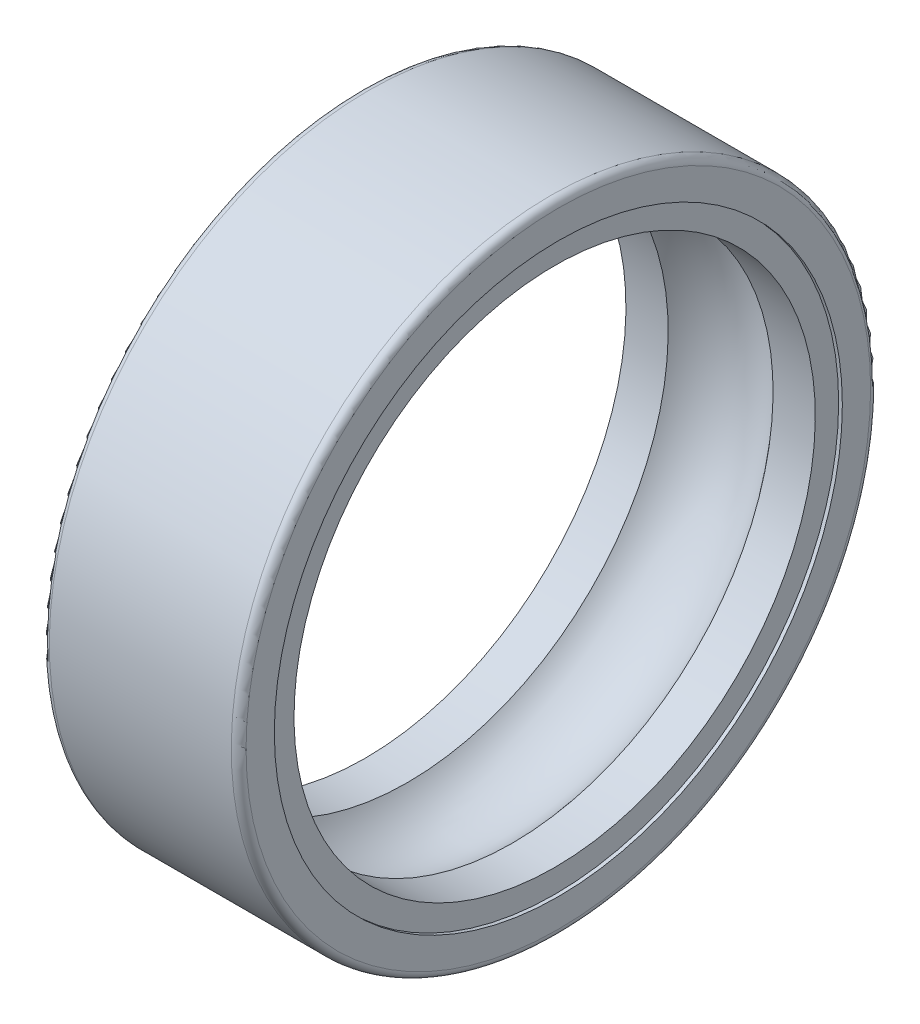
ISO-10303-21;
HEADER;
FILE_DESCRIPTION(('STEP AP214'),'2;1');
FILE_NAME('part.step','',(''),(''),'','','');
FILE_SCHEMA(('AUTOMOTIVE_DESIGN { 1 0 10303 214 1 1 1 1 }'));
ENDSEC;
DATA;
#1=APPLICATION_CONTEXT('core data for automotive mechanical design processes');
#2=APPLICATION_PROTOCOL_DEFINITION('international standard','automotive_design',2000,#1);
#3=PRODUCT_CONTEXT('',#1,'mechanical');
#4=PRODUCT('Part','Part','',(#3));
#5=PRODUCT_RELATED_PRODUCT_CATEGORY('part','',(#4));
#6=PRODUCT_DEFINITION_FORMATION('','',#4);
#7=PRODUCT_DEFINITION_CONTEXT('part definition',#1,'design');
#8=PRODUCT_DEFINITION('design','',#6,#7);
#9=PRODUCT_DEFINITION_SHAPE('','',#8);
#10=(LENGTH_UNIT() NAMED_UNIT(*) SI_UNIT(.MILLI.,.METRE.));
#11=(NAMED_UNIT(*) PLANE_ANGLE_UNIT() SI_UNIT($,.RADIAN.));
#12=(NAMED_UNIT(*) SI_UNIT($,.STERADIAN.) SOLID_ANGLE_UNIT());
#13=UNCERTAINTY_MEASURE_WITH_UNIT(LENGTH_MEASURE(1.E-05),#10,'distance_accuracy_value','');
#14=(GEOMETRIC_REPRESENTATION_CONTEXT(3) GLOBAL_UNCERTAINTY_ASSIGNED_CONTEXT((#13)) GLOBAL_UNIT_ASSIGNED_CONTEXT((#10,
#11,#12)) REPRESENTATION_CONTEXT('',''));
#15=CARTESIAN_POINT('',(0.,0.,0.));
#16=DIRECTION('',(0.,0.,1.));
#17=DIRECTION('',(1.,0.,0.));
#18=AXIS2_PLACEMENT_3D('',#15,#16,#17);
#19=CARTESIAN_POINT('',(3.7,0.,0.));
#20=DIRECTION('',(1.,0.,0.));
#21=DIRECTION('',(0.,0.,-1.));
#22=AXIS2_PLACEMENT_3D('',#19,#20,#21);
#23=TOROIDAL_SURFACE('',#22,12.7,0.3);
#24=CARTESIAN_POINT('',(3.7,0.,0.));
#25=DIRECTION('',(1.,0.,0.));
#26=DIRECTION('',(0.,1.,0.));
#27=AXIS2_PLACEMENT_3D('',#24,#25,#26);
#28=CIRCLE('',#27,13.);
#29=CARTESIAN_POINT('',(3.7,13.,0.));
#30=VERTEX_POINT('',#29);
#31=EDGE_CURVE('E11',#30,#30,#28,.T.);
#32=ORIENTED_EDGE('',*,*,#31,.T.);
#33=EDGE_LOOP('',(#32));
#34=FACE_BOUND('',#33,.T.);
#35=CARTESIAN_POINT('',(4.,0.,0.));
#36=DIRECTION('',(1.,0.,0.));
#37=DIRECTION('',(0.,1.,0.));
#38=AXIS2_PLACEMENT_3D('',#35,#36,#37);
#39=CIRCLE('',#38,12.7);
#40=CARTESIAN_POINT('',(4.,12.7,0.));
#41=VERTEX_POINT('',#40);
#42=EDGE_CURVE('E78',#41,#41,#39,.T.);
#43=ORIENTED_EDGE('',*,*,#42,.F.);
#44=EDGE_LOOP('',(#43));
#45=FACE_BOUND('',#44,.T.);
#46=ADVANCED_FACE('F16',(#34,#45),#23,.T.);
#47=CARTESIAN_POINT('',(0.,0.,0.));
#48=DIRECTION('',(-1.,0.,0.));
#49=DIRECTION('',(0.,1.,0.));
#50=AXIS2_PLACEMENT_3D('',#47,#48,#49);
#51=CYLINDRICAL_SURFACE('',#50,13.);
#52=CARTESIAN_POINT('',(-3.7,0.,0.));
#53=DIRECTION('',(1.,0.,0.));
#54=DIRECTION('',(0.,1.,0.));
#55=AXIS2_PLACEMENT_3D('',#52,#53,#54);
#56=CIRCLE('',#55,13.);
#57=CARTESIAN_POINT('',(-3.7,13.,0.));
#58=VERTEX_POINT('',#57);
#59=EDGE_CURVE('E25',#58,#58,#56,.T.);
#60=ORIENTED_EDGE('',*,*,#59,.T.);
#61=EDGE_LOOP('',(#60));
#62=FACE_BOUND('',#61,.T.);
#63=ORIENTED_EDGE('',*,*,#31,.F.);
#64=EDGE_LOOP('',(#63));
#65=FACE_BOUND('',#64,.T.);
#66=ADVANCED_FACE('F109',(#62,#65),#51,.T.);
#67=CARTESIAN_POINT('',(-3.7,0.,0.));
#68=DIRECTION('',(1.,0.,0.));
#69=DIRECTION('',(0.,0.,-1.));
#70=AXIS2_PLACEMENT_3D('',#67,#68,#69);
#71=TOROIDAL_SURFACE('',#70,12.7,0.3);
#72=CARTESIAN_POINT('',(-4.,0.,0.));
#73=DIRECTION('',(1.,0.,0.));
#74=DIRECTION('',(0.,1.,0.));
#75=AXIS2_PLACEMENT_3D('',#72,#73,#74);
#76=CIRCLE('',#75,12.7);
#77=CARTESIAN_POINT('',(-4.,12.7,0.));
#78=VERTEX_POINT('',#77);
#79=EDGE_CURVE('E75',#78,#78,#76,.T.);
#80=ORIENTED_EDGE('',*,*,#79,.T.);
#81=EDGE_LOOP('',(#80));
#82=FACE_BOUND('',#81,.T.);
#83=ORIENTED_EDGE('',*,*,#59,.F.);
#84=EDGE_LOOP('',(#83));
#85=FACE_BOUND('',#84,.T.);
#86=ADVANCED_FACE('F113',(#82,#85),#71,.T.);
#87=CARTESIAN_POINT('',(-4.,11.65,0.));
#88=DIRECTION('',(-1.,0.,0.));
#89=DIRECTION('',(0.,-1.,0.));
#90=AXIS2_PLACEMENT_3D('',#87,#88,#89);
#91=PLANE('',#90);
#92=ORIENTED_EDGE('',*,*,#79,.F.);
#93=EDGE_LOOP('',(#92));
#94=FACE_BOUND('',#93,.T.);
#95=CARTESIAN_POINT('',(-4.,0.,0.));
#96=DIRECTION('',(1.,0.,0.));
#97=DIRECTION('',(0.,0.,1.));
#98=AXIS2_PLACEMENT_3D('',#95,#96,#97);
#99=CIRCLE('',#98,11.55);
#100=CARTESIAN_POINT('',(-4.,0.,-11.55));
#101=VERTEX_POINT('',#100);
#102=EDGE_CURVE('E65',#101,#101,#99,.T.);
#103=ORIENTED_EDGE('',*,*,#102,.T.);
#104=EDGE_LOOP('',(#103));
#105=FACE_BOUND('',#104,.T.);
#106=ADVANCED_FACE('F66',(#94,#105),#91,.T.);
#107=CARTESIAN_POINT('',(0.,0.,0.));
#108=DIRECTION('',(-1.,0.,0.));
#109=DIRECTION('',(0.,1.,0.));
#110=AXIS2_PLACEMENT_3D('',#107,#108,#109);
#111=CYLINDRICAL_SURFACE('',#110,10.6);
#112=CARTESIAN_POINT('',(-2.13333333333333,0.,0.));
#113=DIRECTION('',(1.,0.,0.));
#114=DIRECTION('',(0.,1.,0.));
#115=AXIS2_PLACEMENT_3D('',#112,#113,#114);
#116=CIRCLE('',#115,10.6);
#117=CARTESIAN_POINT('',(-2.13333333333333,-10.6,0.));
#118=VERTEX_POINT('',#117);
#119=EDGE_CURVE('E81',#118,#118,#116,.T.);
#120=ORIENTED_EDGE('',*,*,#119,.T.);
#121=EDGE_LOOP('',(#120));
#122=FACE_BOUND('',#121,.T.);
#123=CARTESIAN_POINT('',(-3.85,0.,0.));
#124=DIRECTION('',(-1.,0.,0.));
#125=DIRECTION('',(0.,1.,0.));
#126=AXIS2_PLACEMENT_3D('',#123,#124,#125);
#127=CIRCLE('',#126,10.6);
#128=CARTESIAN_POINT('',(-3.85,-10.6,0.));
#129=VERTEX_POINT('',#128);
#130=EDGE_CURVE('E70',#129,#129,#127,.T.);
#131=ORIENTED_EDGE('',*,*,#130,.T.);
#132=EDGE_LOOP('',(#131));
#133=FACE_BOUND('',#132,.T.);
#134=ADVANCED_FACE('F88',(#122,#133),#111,.F.);
#135=CARTESIAN_POINT('',(4.,11.65,0.));
#136=DIRECTION('',(1.,0.,0.));
#137=DIRECTION('',(0.,1.,0.));
#138=AXIS2_PLACEMENT_3D('',#135,#136,#137);
#139=PLANE('',#138);
#140=ORIENTED_EDGE('',*,*,#42,.T.);
#141=EDGE_LOOP('',(#140));
#142=FACE_BOUND('',#141,.T.);
#143=CARTESIAN_POINT('',(4.,0.,0.));
#144=DIRECTION('',(-1.,0.,0.));
#145=DIRECTION('',(0.,0.,-1.));
#146=AXIS2_PLACEMENT_3D('',#143,#144,#145);
#147=CIRCLE('',#146,11.55);
#148=CARTESIAN_POINT('',(4.,0.,11.55));
#149=VERTEX_POINT('',#148);
#150=EDGE_CURVE('E57',#149,#149,#147,.T.);
#151=ORIENTED_EDGE('',*,*,#150,.T.);
#152=EDGE_LOOP('',(#151));
#153=FACE_BOUND('',#152,.T.);
#154=ADVANCED_FACE('F119',(#142,#153),#139,.T.);
#155=CARTESIAN_POINT('',(0.,0.,0.));
#156=DIRECTION('',(-1.,0.,0.));
#157=DIRECTION('',(0.,1.,0.));
#158=AXIS2_PLACEMENT_3D('',#155,#156,#157);
#159=CYLINDRICAL_SURFACE('',#158,10.6);
#160=CARTESIAN_POINT('',(2.13333333333333,0.,0.));
#161=DIRECTION('',(-1.,0.,0.));
#162=DIRECTION('',(0.,1.,0.));
#163=AXIS2_PLACEMENT_3D('',#160,#161,#162);
#164=CIRCLE('',#163,10.6);
#165=CARTESIAN_POINT('',(2.13333333333333,-10.6,0.));
#166=VERTEX_POINT('',#165);
#167=EDGE_CURVE('E83',#166,#166,#164,.T.);
#168=ORIENTED_EDGE('',*,*,#167,.T.);
#169=EDGE_LOOP('',(#168));
#170=FACE_BOUND('',#169,.T.);
#171=CARTESIAN_POINT('',(3.85,0.,0.));
#172=DIRECTION('',(1.,0.,0.));
#173=DIRECTION('',(0.,1.,0.));
#174=AXIS2_PLACEMENT_3D('',#171,#172,#173);
#175=CIRCLE('',#174,10.6);
#176=CARTESIAN_POINT('',(3.85,-10.6,0.));
#177=VERTEX_POINT('',#176);
#178=EDGE_CURVE('E79',#177,#177,#175,.T.);
#179=ORIENTED_EDGE('',*,*,#178,.T.);
#180=EDGE_LOOP('',(#179));
#181=FACE_BOUND('',#180,.T.);
#182=ADVANCED_FACE('F121',(#170,#181),#159,.F.);
#183=CARTESIAN_POINT('',(0.,0.,0.));
#184=DIRECTION('',(1.,0.,0.));
#185=DIRECTION('',(0.,0.,-1.));
#186=AXIS2_PLACEMENT_3D('',#183,#184,#185);
#187=TOROIDAL_SURFACE('',#186,9.,2.66666666666666);
#188=ORIENTED_EDGE('',*,*,#167,.F.);
#189=EDGE_LOOP('',(#188));
#190=FACE_BOUND('',#189,.T.);
#191=ORIENTED_EDGE('',*,*,#119,.F.);
#192=EDGE_LOOP('',(#191));
#193=FACE_BOUND('',#192,.T.);
#194=ADVANCED_FACE('F127',(#190,#193),#187,.F.);
#195=CARTESIAN_POINT('',(3.85,0.,0.));
#196=DIRECTION('',(-1.,0.,0.));
#197=DIRECTION('',(0.,0.,1.));
#198=AXIS2_PLACEMENT_3D('',#195,#196,#197);
#199=PLANE('',#198);
#200=CARTESIAN_POINT('',(3.85,0.,0.));
#201=DIRECTION('',(-1.,0.,0.));
#202=DIRECTION('',(0.,0.,-1.));
#203=AXIS2_PLACEMENT_3D('',#200,#201,#202);
#204=CIRCLE('',#203,11.55);
#205=CARTESIAN_POINT('',(3.85,0.,-11.55));
#206=VERTEX_POINT('',#205);
#207=EDGE_CURVE('E19',#206,#206,#204,.T.);
#208=ORIENTED_EDGE('',*,*,#207,.F.);
#209=EDGE_LOOP('',(#208));
#210=FACE_BOUND('',#209,.T.);
#211=ORIENTED_EDGE('',*,*,#178,.F.);
#212=EDGE_LOOP('',(#211));
#213=FACE_BOUND('',#212,.T.);
#214=ADVANCED_FACE('F103',(#210,#213),#199,.F.);
#215=CARTESIAN_POINT('',(4.425,0.,0.));
#216=DIRECTION('',(-1.,0.,0.));
#217=DIRECTION('',(0.,0.,-1.));
#218=AXIS2_PLACEMENT_3D('',#215,#216,#217);
#219=CYLINDRICAL_SURFACE('',#218,11.55);
#220=ORIENTED_EDGE('',*,*,#207,.T.);
#221=EDGE_LOOP('',(#220));
#222=FACE_BOUND('',#221,.T.);
#223=ORIENTED_EDGE('',*,*,#150,.F.);
#224=EDGE_LOOP('',(#223));
#225=FACE_BOUND('',#224,.T.);
#226=ADVANCED_FACE('F93',(#222,#225),#219,.F.);
#227=CARTESIAN_POINT('',(-3.85,0.,0.));
#228=DIRECTION('',(1.,0.,0.));
#229=DIRECTION('',(0.,0.,-1.));
#230=AXIS2_PLACEMENT_3D('',#227,#228,#229);
#231=PLANE('',#230);
#232=CARTESIAN_POINT('',(-3.85,0.,0.));
#233=DIRECTION('',(1.,0.,0.));
#234=DIRECTION('',(0.,0.,1.));
#235=AXIS2_PLACEMENT_3D('',#232,#233,#234);
#236=CIRCLE('',#235,11.55);
#237=CARTESIAN_POINT('',(-3.85,0.,11.55));
#238=VERTEX_POINT('',#237);
#239=EDGE_CURVE('E68',#238,#238,#236,.T.);
#240=ORIENTED_EDGE('',*,*,#239,.F.);
#241=EDGE_LOOP('',(#240));
#242=FACE_BOUND('',#241,.T.);
#243=ORIENTED_EDGE('',*,*,#130,.F.);
#244=EDGE_LOOP('',(#243));
#245=FACE_BOUND('',#244,.T.);
#246=ADVANCED_FACE('F90',(#242,#245),#231,.F.);
#247=CARTESIAN_POINT('',(-4.425,0.,0.));
#248=DIRECTION('',(1.,0.,0.));
#249=DIRECTION('',(0.,0.,1.));
#250=AXIS2_PLACEMENT_3D('',#247,#248,#249);
#251=CYLINDRICAL_SURFACE('',#250,11.55);
#252=ORIENTED_EDGE('',*,*,#239,.T.);
#253=EDGE_LOOP('',(#252));
#254=FACE_BOUND('',#253,.T.);
#255=ORIENTED_EDGE('',*,*,#102,.F.);
#256=EDGE_LOOP('',(#255));
#257=FACE_BOUND('',#256,.T.);
#258=ADVANCED_FACE('F92',(#254,#257),#251,.F.);
#259=CLOSED_SHELL('',(#46,#66,#86,#106,#134,#154,#182,#194,#214,#226,#246,#258));
#260=MANIFOLD_SOLID_BREP('B1',#259);
#261=ADVANCED_BREP_SHAPE_REPRESENTATION('',(#18,#260),#14);
#262=SHAPE_DEFINITION_REPRESENTATION(#9,#261);
ENDSEC;
END-ISO-10303-21;
